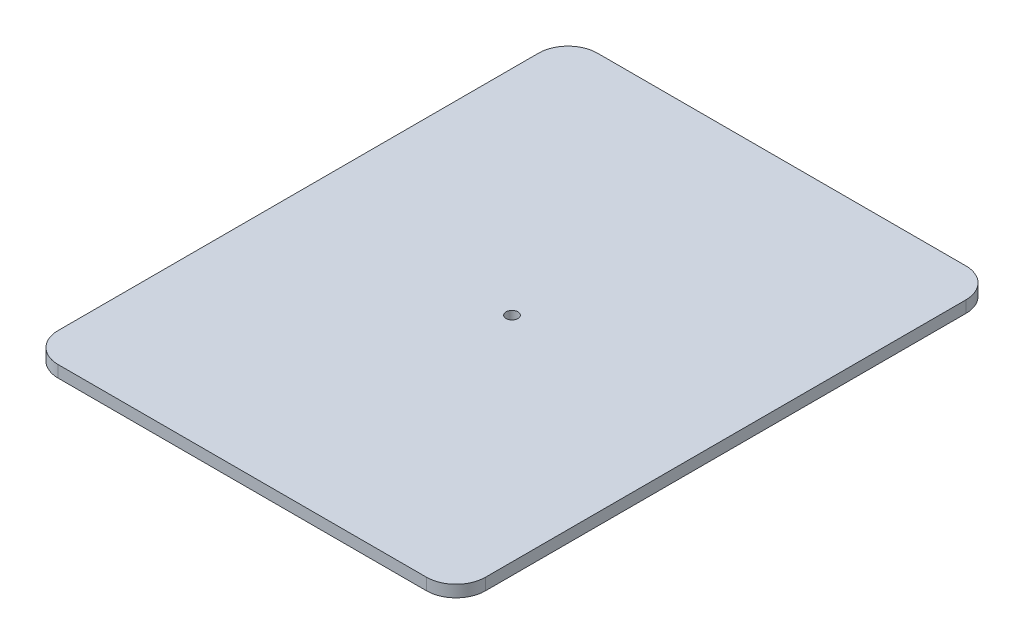
ISO-10303-21;
HEADER;
FILE_DESCRIPTION(('STEP AP214'),'2;1');
FILE_NAME('part.step','',(''),(''),'','','');
FILE_SCHEMA(('AUTOMOTIVE_DESIGN { 1 0 10303 214 1 1 1 1 }'));
ENDSEC;
DATA;
#1=APPLICATION_CONTEXT('core data for automotive mechanical design processes');
#2=APPLICATION_PROTOCOL_DEFINITION('international standard','automotive_design',2000,#1);
#3=PRODUCT_CONTEXT('',#1,'mechanical');
#4=PRODUCT('Part','Part','',(#3));
#5=PRODUCT_RELATED_PRODUCT_CATEGORY('part','',(#4));
#6=PRODUCT_DEFINITION_FORMATION('','',#4);
#7=PRODUCT_DEFINITION_CONTEXT('part definition',#1,'design');
#8=PRODUCT_DEFINITION('design','',#6,#7);
#9=PRODUCT_DEFINITION_SHAPE('','',#8);
#10=(LENGTH_UNIT() NAMED_UNIT(*) SI_UNIT(.MILLI.,.METRE.));
#11=(NAMED_UNIT(*) PLANE_ANGLE_UNIT() SI_UNIT($,.RADIAN.));
#12=(NAMED_UNIT(*) SI_UNIT($,.STERADIAN.) SOLID_ANGLE_UNIT());
#13=UNCERTAINTY_MEASURE_WITH_UNIT(LENGTH_MEASURE(1.E-05),#10,'distance_accuracy_value','');
#14=(GEOMETRIC_REPRESENTATION_CONTEXT(3) GLOBAL_UNCERTAINTY_ASSIGNED_CONTEXT((#13)) GLOBAL_UNIT_ASSIGNED_CONTEXT((#10,
#11,#12)) REPRESENTATION_CONTEXT('',''));
#15=CARTESIAN_POINT('',(0.,0.,0.));
#16=DIRECTION('',(0.,0.,1.));
#17=DIRECTION('',(1.,0.,0.));
#18=AXIS2_PLACEMENT_3D('',#15,#16,#17);
#19=CARTESIAN_POINT('',(0.,4.,0.));
#20=DIRECTION('',(0.,-1.,0.));
#21=DIRECTION('',(0.,0.,-1.));
#22=AXIS2_PLACEMENT_3D('',#19,#20,#21);
#23=PLANE('',#22);
#24=CARTESIAN_POINT('',(0.,4.,0.));
#25=DIRECTION('',(0.,1.,0.));
#26=DIRECTION('',(0.,0.,1.));
#27=AXIS2_PLACEMENT_3D('',#24,#25,#26);
#28=CIRCLE('',#27,2.);
#29=CARTESIAN_POINT('',(0.,4.,2.));
#30=VERTEX_POINT('',#29);
#31=EDGE_CURVE('E149',#30,#30,#28,.T.);
#32=ORIENTED_EDGE('',*,*,#31,.F.);
#33=EDGE_LOOP('',(#32));
#34=FACE_BOUND('',#33,.T.);
#35=CARTESIAN_POINT('',(-62.5,4.,81.5));
#36=DIRECTION('',(0.,1.,0.));
#37=DIRECTION('',(0.,0.,1.));
#38=AXIS2_PLACEMENT_3D('',#35,#36,#37);
#39=CIRCLE('',#38,10.);
#40=CARTESIAN_POINT('',(-72.5,4.,81.5));
#41=VERTEX_POINT('',#40);
#42=CARTESIAN_POINT('',(-62.5,4.,91.5));
#43=VERTEX_POINT('',#42);
#44=EDGE_CURVE('E123',#41,#43,#39,.T.);
#45=ORIENTED_EDGE('',*,*,#44,.T.);
#46=DIRECTION('',(1.,0.,0.));
#47=VECTOR('',#46,1.);
#48=CARTESIAN_POINT('',(-62.5,4.,91.5));
#49=LINE('',#48,#47);
#50=CARTESIAN_POINT('',(62.5,4.,91.5));
#51=VERTEX_POINT('',#50);
#52=EDGE_CURVE('E121',#43,#51,#49,.T.);
#53=ORIENTED_EDGE('',*,*,#52,.T.);
#54=CARTESIAN_POINT('',(62.5,4.,81.5));
#55=DIRECTION('',(0.,1.,0.));
#56=DIRECTION('',(0.,0.,1.));
#57=AXIS2_PLACEMENT_3D('',#54,#55,#56);
#58=CIRCLE('',#57,9.99999999999999);
#59=CARTESIAN_POINT('',(72.5,4.,81.5));
#60=VERTEX_POINT('',#59);
#61=EDGE_CURVE('E51',#51,#60,#58,.T.);
#62=ORIENTED_EDGE('',*,*,#61,.T.);
#63=DIRECTION('',(0.,0.,-1.));
#64=VECTOR('',#63,1.);
#65=CARTESIAN_POINT('',(72.5,4.,-81.5));
#66=LINE('',#65,#64);
#67=CARTESIAN_POINT('',(72.5,4.,-81.5));
#68=VERTEX_POINT('',#67);
#69=EDGE_CURVE('E111',#60,#68,#66,.T.);
#70=ORIENTED_EDGE('',*,*,#69,.T.);
#71=CARTESIAN_POINT('',(62.5,4.,-81.5));
#72=DIRECTION('',(0.,1.,0.));
#73=DIRECTION('',(0.,0.,-1.));
#74=AXIS2_PLACEMENT_3D('',#71,#72,#73);
#75=CIRCLE('',#74,10.);
#76=CARTESIAN_POINT('',(62.5,4.,-91.5));
#77=VERTEX_POINT('',#76);
#78=EDGE_CURVE('E117',#68,#77,#75,.T.);
#79=ORIENTED_EDGE('',*,*,#78,.T.);
#80=DIRECTION('',(-1.,0.,0.));
#81=VECTOR('',#80,1.);
#82=CARTESIAN_POINT('',(-62.5,4.,-91.5));
#83=LINE('',#82,#81);
#84=CARTESIAN_POINT('',(-62.5,4.,-91.5));
#85=VERTEX_POINT('',#84);
#86=EDGE_CURVE('E128',#77,#85,#83,.T.);
#87=ORIENTED_EDGE('',*,*,#86,.T.);
#88=CARTESIAN_POINT('',(-62.5,4.,-81.5));
#89=DIRECTION('',(0.,1.,0.));
#90=DIRECTION('',(0.,0.,1.));
#91=AXIS2_PLACEMENT_3D('',#88,#89,#90);
#92=CIRCLE('',#91,10.);
#93=CARTESIAN_POINT('',(-72.5,4.,-81.5));
#94=VERTEX_POINT('',#93);
#95=EDGE_CURVE('E131',#85,#94,#92,.T.);
#96=ORIENTED_EDGE('',*,*,#95,.T.);
#97=DIRECTION('',(0.,0.,1.));
#98=VECTOR('',#97,1.);
#99=CARTESIAN_POINT('',(-72.5,4.,-81.5));
#100=LINE('',#99,#98);
#101=EDGE_CURVE('E134',#94,#41,#100,.T.);
#102=ORIENTED_EDGE('',*,*,#101,.T.);
#103=EDGE_LOOP('',(#45,#53,#62,#70,#79,#87,#96,#102));
#104=FACE_BOUND('',#103,.T.);
#105=ADVANCED_FACE('F36',(#34,#104),#23,.F.);
#106=CARTESIAN_POINT('',(0.,0.,0.));
#107=DIRECTION('',(0.,-1.,0.));
#108=DIRECTION('',(0.,0.,-1.));
#109=AXIS2_PLACEMENT_3D('',#106,#107,#108);
#110=PLANE('',#109);
#111=CARTESIAN_POINT('',(0.,0.,0.));
#112=DIRECTION('',(0.,1.,0.));
#113=DIRECTION('',(0.,0.,1.));
#114=AXIS2_PLACEMENT_3D('',#111,#112,#113);
#115=CIRCLE('',#114,2.);
#116=CARTESIAN_POINT('',(0.,0.,2.));
#117=VERTEX_POINT('',#116);
#118=EDGE_CURVE('E139',#117,#117,#115,.T.);
#119=ORIENTED_EDGE('',*,*,#118,.T.);
#120=EDGE_LOOP('',(#119));
#121=FACE_BOUND('',#120,.T.);
#122=DIRECTION('',(-1.,0.,0.));
#123=VECTOR('',#122,1.);
#124=CARTESIAN_POINT('',(0.,0.,91.5));
#125=LINE('',#124,#123);
#126=CARTESIAN_POINT('',(62.5,0.,91.5));
#127=VERTEX_POINT('',#126);
#128=CARTESIAN_POINT('',(-62.5,0.,91.5));
#129=VERTEX_POINT('',#128);
#130=EDGE_CURVE('E152',#127,#129,#125,.T.);
#131=ORIENTED_EDGE('',*,*,#130,.T.);
#132=CARTESIAN_POINT('',(-62.5,0.,81.5));
#133=DIRECTION('',(0.,-1.,0.));
#134=DIRECTION('',(0.,0.,-1.));
#135=AXIS2_PLACEMENT_3D('',#132,#133,#134);
#136=CIRCLE('',#135,10.);
#137=CARTESIAN_POINT('',(-72.5,0.,81.5));
#138=VERTEX_POINT('',#137);
#139=EDGE_CURVE('E11',#129,#138,#136,.T.);
#140=ORIENTED_EDGE('',*,*,#139,.T.);
#141=DIRECTION('',(0.,0.,-1.));
#142=VECTOR('',#141,1.);
#143=CARTESIAN_POINT('',(-72.5,0.,0.));
#144=LINE('',#143,#142);
#145=CARTESIAN_POINT('',(-72.5,0.,-81.5));
#146=VERTEX_POINT('',#145);
#147=EDGE_CURVE('E44',#138,#146,#144,.T.);
#148=ORIENTED_EDGE('',*,*,#147,.T.);
#149=CARTESIAN_POINT('',(-62.5,0.,-81.5));
#150=DIRECTION('',(0.,-1.,0.));
#151=DIRECTION('',(0.,0.,-1.));
#152=AXIS2_PLACEMENT_3D('',#149,#150,#151);
#153=CIRCLE('',#152,10.);
#154=CARTESIAN_POINT('',(-62.5,0.,-91.5));
#155=VERTEX_POINT('',#154);
#156=EDGE_CURVE('E166',#146,#155,#153,.T.);
#157=ORIENTED_EDGE('',*,*,#156,.T.);
#158=DIRECTION('',(1.,0.,0.));
#159=VECTOR('',#158,1.);
#160=CARTESIAN_POINT('',(0.,0.,-91.5));
#161=LINE('',#160,#159);
#162=CARTESIAN_POINT('',(62.5,0.,-91.5));
#163=VERTEX_POINT('',#162);
#164=EDGE_CURVE('E163',#155,#163,#161,.T.);
#165=ORIENTED_EDGE('',*,*,#164,.T.);
#166=CARTESIAN_POINT('',(62.5,0.,-81.5));
#167=DIRECTION('',(0.,-1.,0.));
#168=DIRECTION('',(0.,0.,-1.));
#169=AXIS2_PLACEMENT_3D('',#166,#167,#168);
#170=CIRCLE('',#169,10.);
#171=CARTESIAN_POINT('',(72.5,0.,-81.5));
#172=VERTEX_POINT('',#171);
#173=EDGE_CURVE('E160',#163,#172,#170,.T.);
#174=ORIENTED_EDGE('',*,*,#173,.T.);
#175=DIRECTION('',(0.,0.,1.));
#176=VECTOR('',#175,1.);
#177=CARTESIAN_POINT('',(72.5,0.,0.));
#178=LINE('',#177,#176);
#179=CARTESIAN_POINT('',(72.5,0.,81.5));
#180=VERTEX_POINT('',#179);
#181=EDGE_CURVE('E158',#172,#180,#178,.T.);
#182=ORIENTED_EDGE('',*,*,#181,.T.);
#183=CARTESIAN_POINT('',(62.5,0.,81.5));
#184=DIRECTION('',(0.,-1.,0.));
#185=DIRECTION('',(0.,0.,-1.));
#186=AXIS2_PLACEMENT_3D('',#183,#184,#185);
#187=CIRCLE('',#186,9.99999999999999);
#188=EDGE_CURVE('E104',#180,#127,#187,.T.);
#189=ORIENTED_EDGE('',*,*,#188,.T.);
#190=EDGE_LOOP('',(#131,#140,#148,#157,#165,#174,#182,#189));
#191=FACE_BOUND('',#190,.T.);
#192=ADVANCED_FACE('F38',(#121,#191),#110,.T.);
#193=CARTESIAN_POINT('',(0.,4.,0.));
#194=DIRECTION('',(0.,-1.,0.));
#195=DIRECTION('',(0.,0.,-1.));
#196=AXIS2_PLACEMENT_3D('',#193,#194,#195);
#197=CYLINDRICAL_SURFACE('',#196,2.);
#198=ORIENTED_EDGE('',*,*,#31,.T.);
#199=EDGE_LOOP('',(#198));
#200=FACE_BOUND('',#199,.T.);
#201=ORIENTED_EDGE('',*,*,#118,.F.);
#202=EDGE_LOOP('',(#201));
#203=FACE_BOUND('',#202,.T.);
#204=ADVANCED_FACE('F201',(#200,#203),#197,.F.);
#205=CARTESIAN_POINT('',(-62.5,-6.,81.5));
#206=DIRECTION('',(0.,1.,0.));
#207=DIRECTION('',(0.,0.,1.));
#208=AXIS2_PLACEMENT_3D('',#205,#206,#207);
#209=CYLINDRICAL_SURFACE('',#208,10.);
#210=DIRECTION('',(0.,1.,0.));
#211=VECTOR('',#210,1.);
#212=CARTESIAN_POINT('',(-62.5,-6.,91.5));
#213=LINE('',#212,#211);
#214=EDGE_CURVE('E59',#129,#43,#213,.T.);
#215=ORIENTED_EDGE('',*,*,#214,.T.);
#216=ORIENTED_EDGE('',*,*,#44,.F.);
#217=DIRECTION('',(0.,1.,0.));
#218=VECTOR('',#217,1.);
#219=CARTESIAN_POINT('',(-72.5,-6.,81.5));
#220=LINE('',#219,#218);
#221=EDGE_CURVE('E137',#138,#41,#220,.T.);
#222=ORIENTED_EDGE('',*,*,#221,.F.);
#223=ORIENTED_EDGE('',*,*,#139,.F.);
#224=EDGE_LOOP('',(#215,#216,#222,#223));
#225=FACE_BOUND('',#224,.T.);
#226=ADVANCED_FACE('F177',(#225),#209,.T.);
#227=CARTESIAN_POINT('',(-72.5,-6.,-81.5));
#228=DIRECTION('',(-1.,0.,0.));
#229=DIRECTION('',(0.,0.,1.));
#230=AXIS2_PLACEMENT_3D('',#227,#228,#229);
#231=PLANE('',#230);
#232=ORIENTED_EDGE('',*,*,#221,.T.);
#233=ORIENTED_EDGE('',*,*,#101,.F.);
#234=DIRECTION('',(0.,1.,0.));
#235=VECTOR('',#234,1.);
#236=CARTESIAN_POINT('',(-72.5,-6.,-81.5));
#237=LINE('',#236,#235);
#238=EDGE_CURVE('E140',#146,#94,#237,.T.);
#239=ORIENTED_EDGE('',*,*,#238,.F.);
#240=ORIENTED_EDGE('',*,*,#147,.F.);
#241=EDGE_LOOP('',(#232,#233,#239,#240));
#242=FACE_BOUND('',#241,.T.);
#243=ADVANCED_FACE('F173',(#242),#231,.T.);
#244=CARTESIAN_POINT('',(-62.5,-6.,-81.5));
#245=DIRECTION('',(0.,1.,0.));
#246=DIRECTION('',(0.,0.,1.));
#247=AXIS2_PLACEMENT_3D('',#244,#245,#246);
#248=CYLINDRICAL_SURFACE('',#247,10.);
#249=ORIENTED_EDGE('',*,*,#238,.T.);
#250=ORIENTED_EDGE('',*,*,#95,.F.);
#251=DIRECTION('',(0.,1.,0.));
#252=VECTOR('',#251,1.);
#253=CARTESIAN_POINT('',(-62.5,-6.,-91.5));
#254=LINE('',#253,#252);
#255=EDGE_CURVE('E142',#155,#85,#254,.T.);
#256=ORIENTED_EDGE('',*,*,#255,.F.);
#257=ORIENTED_EDGE('',*,*,#156,.F.);
#258=EDGE_LOOP('',(#249,#250,#256,#257));
#259=FACE_BOUND('',#258,.T.);
#260=ADVANCED_FACE('F182',(#259),#248,.T.);
#261=CARTESIAN_POINT('',(-62.5,-6.,-91.5));
#262=DIRECTION('',(0.,0.,-1.));
#263=DIRECTION('',(-1.,0.,0.));
#264=AXIS2_PLACEMENT_3D('',#261,#262,#263);
#265=PLANE('',#264);
#266=ORIENTED_EDGE('',*,*,#255,.T.);
#267=ORIENTED_EDGE('',*,*,#86,.F.);
#268=DIRECTION('',(0.,1.,0.));
#269=VECTOR('',#268,1.);
#270=CARTESIAN_POINT('',(62.5,-6.,-91.5));
#271=LINE('',#270,#269);
#272=EDGE_CURVE('E144',#163,#77,#271,.T.);
#273=ORIENTED_EDGE('',*,*,#272,.F.);
#274=ORIENTED_EDGE('',*,*,#164,.F.);
#275=EDGE_LOOP('',(#266,#267,#273,#274));
#276=FACE_BOUND('',#275,.T.);
#277=ADVANCED_FACE('F184',(#276),#265,.T.);
#278=CARTESIAN_POINT('',(62.5,-6.,-81.5));
#279=DIRECTION('',(0.,1.,0.));
#280=DIRECTION('',(0.,0.,1.));
#281=AXIS2_PLACEMENT_3D('',#278,#279,#280);
#282=CYLINDRICAL_SURFACE('',#281,10.);
#283=ORIENTED_EDGE('',*,*,#272,.T.);
#284=ORIENTED_EDGE('',*,*,#78,.F.);
#285=DIRECTION('',(0.,1.,0.));
#286=VECTOR('',#285,1.);
#287=CARTESIAN_POINT('',(72.5,-6.,-81.5));
#288=LINE('',#287,#286);
#289=EDGE_CURVE('E107',#172,#68,#288,.T.);
#290=ORIENTED_EDGE('',*,*,#289,.F.);
#291=ORIENTED_EDGE('',*,*,#173,.F.);
#292=EDGE_LOOP('',(#283,#284,#290,#291));
#293=FACE_BOUND('',#292,.T.);
#294=ADVANCED_FACE('F187',(#293),#282,.T.);
#295=CARTESIAN_POINT('',(72.5,-6.,-81.5));
#296=DIRECTION('',(1.,0.,0.));
#297=DIRECTION('',(0.,0.,-1.));
#298=AXIS2_PLACEMENT_3D('',#295,#296,#297);
#299=PLANE('',#298);
#300=ORIENTED_EDGE('',*,*,#289,.T.);
#301=ORIENTED_EDGE('',*,*,#69,.F.);
#302=DIRECTION('',(0.,1.,0.));
#303=VECTOR('',#302,1.);
#304=CARTESIAN_POINT('',(72.5,-6.,81.5));
#305=LINE('',#304,#303);
#306=EDGE_CURVE('E100',#180,#60,#305,.T.);
#307=ORIENTED_EDGE('',*,*,#306,.F.);
#308=ORIENTED_EDGE('',*,*,#181,.F.);
#309=EDGE_LOOP('',(#300,#301,#307,#308));
#310=FACE_BOUND('',#309,.T.);
#311=ADVANCED_FACE('F112',(#310),#299,.T.);
#312=CARTESIAN_POINT('',(62.5,-6.,81.5));
#313=DIRECTION('',(0.,1.,0.));
#314=DIRECTION('',(0.,0.,1.));
#315=AXIS2_PLACEMENT_3D('',#312,#313,#314);
#316=CYLINDRICAL_SURFACE('',#315,9.99999999999999);
#317=ORIENTED_EDGE('',*,*,#306,.T.);
#318=ORIENTED_EDGE('',*,*,#61,.F.);
#319=DIRECTION('',(0.,1.,0.));
#320=VECTOR('',#319,1.);
#321=CARTESIAN_POINT('',(62.5,-6.,91.5));
#322=LINE('',#321,#320);
#323=EDGE_CURVE('E108',#127,#51,#322,.T.);
#324=ORIENTED_EDGE('',*,*,#323,.F.);
#325=ORIENTED_EDGE('',*,*,#188,.F.);
#326=EDGE_LOOP('',(#317,#318,#324,#325));
#327=FACE_BOUND('',#326,.T.);
#328=ADVANCED_FACE('F102',(#327),#316,.T.);
#329=CARTESIAN_POINT('',(-62.5,-6.,91.5));
#330=DIRECTION('',(0.,0.,1.));
#331=DIRECTION('',(1.,0.,0.));
#332=AXIS2_PLACEMENT_3D('',#329,#330,#331);
#333=PLANE('',#332);
#334=ORIENTED_EDGE('',*,*,#323,.T.);
#335=ORIENTED_EDGE('',*,*,#52,.F.);
#336=ORIENTED_EDGE('',*,*,#214,.F.);
#337=ORIENTED_EDGE('',*,*,#130,.F.);
#338=EDGE_LOOP('',(#334,#335,#336,#337));
#339=FACE_BOUND('',#338,.T.);
#340=ADVANCED_FACE('F210',(#339),#333,.T.);
#341=CLOSED_SHELL('',(#105,#192,#204,#226,#243,#260,#277,#294,#311,#328,#340));
#342=MANIFOLD_SOLID_BREP('B2',#341);
#343=ADVANCED_BREP_SHAPE_REPRESENTATION('',(#18,#342),#14);
#344=SHAPE_DEFINITION_REPRESENTATION(#9,#343);
ENDSEC;
END-ISO-10303-21;
